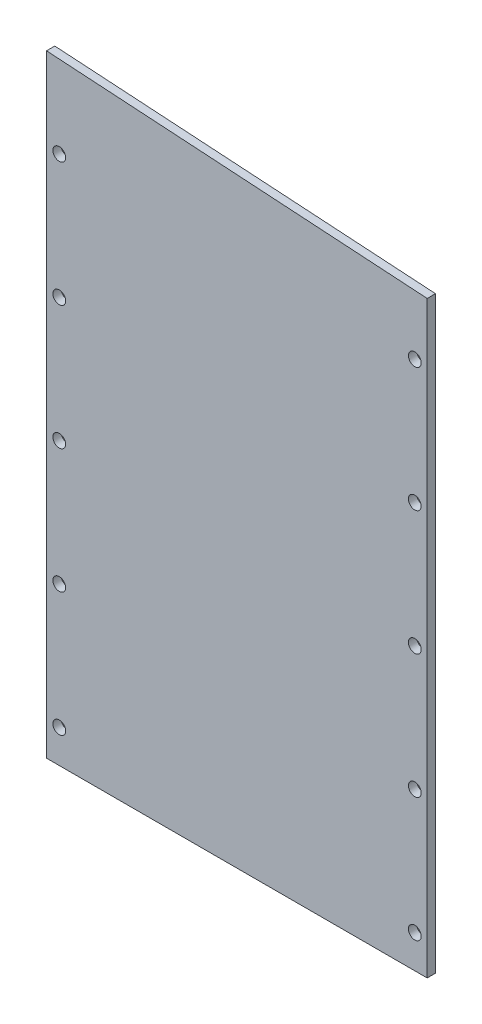
ISO-10303-21;
HEADER;
FILE_DESCRIPTION(('STEP AP214'),'2;1');
FILE_NAME('part.step','',(''),(''),'','','');
FILE_SCHEMA(('AUTOMOTIVE_DESIGN { 1 0 10303 214 1 1 1 1 }'));
ENDSEC;
DATA;
#1=APPLICATION_CONTEXT('core data for automotive mechanical design processes');
#2=APPLICATION_PROTOCOL_DEFINITION('international standard','automotive_design',2000,#1);
#3=PRODUCT_CONTEXT('',#1,'mechanical');
#4=PRODUCT('Part','Part','',(#3));
#5=PRODUCT_RELATED_PRODUCT_CATEGORY('part','',(#4));
#6=PRODUCT_DEFINITION_FORMATION('','',#4);
#7=PRODUCT_DEFINITION_CONTEXT('part definition',#1,'design');
#8=PRODUCT_DEFINITION('design','',#6,#7);
#9=PRODUCT_DEFINITION_SHAPE('','',#8);
#10=(LENGTH_UNIT() NAMED_UNIT(*) SI_UNIT(.MILLI.,.METRE.));
#11=(NAMED_UNIT(*) PLANE_ANGLE_UNIT() SI_UNIT($,.RADIAN.));
#12=(NAMED_UNIT(*) SI_UNIT($,.STERADIAN.) SOLID_ANGLE_UNIT());
#13=UNCERTAINTY_MEASURE_WITH_UNIT(LENGTH_MEASURE(1.E-05),#10,'distance_accuracy_value','');
#14=(GEOMETRIC_REPRESENTATION_CONTEXT(3) GLOBAL_UNCERTAINTY_ASSIGNED_CONTEXT((#13)) GLOBAL_UNIT_ASSIGNED_CONTEXT((#10,
#11,#12)) REPRESENTATION_CONTEXT('',''));
#15=CARTESIAN_POINT('',(0.,0.,0.));
#16=DIRECTION('',(0.,0.,1.));
#17=DIRECTION('',(1.,0.,0.));
#18=AXIS2_PLACEMENT_3D('',#15,#16,#17);
#19=CARTESIAN_POINT('',(-829.363556946388,6406.61289504105,3.175));
#20=DIRECTION('',(-1.,0.,0.));
#21=DIRECTION('',(0.,0.,1.));
#22=AXIS2_PLACEMENT_3D('',#19,#20,#21);
#23=PLANE('',#22);
#24=DIRECTION('',(0.,1.,0.));
#25=VECTOR('',#24,1.);
#26=CARTESIAN_POINT('',(-829.363556946388,6406.61289504105,0.));
#27=LINE('',#26,#25);
#28=CARTESIAN_POINT('',(-829.363556946388,6406.61289504105,0.));
#29=VERTEX_POINT('',#28);
#30=CARTESIAN_POINT('',(-829.363556946388,6632.38959884214,0.));
#31=VERTEX_POINT('',#30);
#32=EDGE_CURVE('E106',#29,#31,#27,.T.);
#33=ORIENTED_EDGE('',*,*,#32,.T.);
#34=DIRECTION('',(0.,0.,-1.));
#35=VECTOR('',#34,1.);
#36=CARTESIAN_POINT('',(-829.363556946388,6632.38959884214,3.175));
#37=LINE('',#36,#35);
#38=CARTESIAN_POINT('',(-829.363556946388,6632.38959884214,3.175));
#39=VERTEX_POINT('',#38);
#40=EDGE_CURVE('E11',#39,#31,#37,.T.);
#41=ORIENTED_EDGE('',*,*,#40,.F.);
#42=DIRECTION('',(0.,1.,0.));
#43=VECTOR('',#42,1.);
#44=CARTESIAN_POINT('',(-829.363556946388,6406.61289504105,3.175));
#45=LINE('',#44,#43);
#46=CARTESIAN_POINT('',(-829.363556946388,6406.61289504105,3.175));
#47=VERTEX_POINT('',#46);
#48=EDGE_CURVE('E88',#47,#39,#45,.T.);
#49=ORIENTED_EDGE('',*,*,#48,.F.);
#50=DIRECTION('',(0.,0.,-1.));
#51=VECTOR('',#50,1.);
#52=CARTESIAN_POINT('',(-829.363556946388,6406.61289504105,3.175));
#53=LINE('',#52,#51);
#54=EDGE_CURVE('E102',#47,#29,#53,.T.);
#55=ORIENTED_EDGE('',*,*,#54,.T.);
#56=EDGE_LOOP('',(#33,#41,#49,#55));
#57=FACE_BOUND('',#56,.T.);
#58=ADVANCED_FACE('F36',(#57),#23,.F.);
#59=CARTESIAN_POINT('',(-829.363556946388,6632.38959884214,3.175));
#60=DIRECTION('',(-0.0632532756957823,-0.997997506566902,0.));
#61=DIRECTION('',(0.997997506566902,-0.0632532756957823,0.));
#62=AXIS2_PLACEMENT_3D('',#59,#60,#61);
#63=PLANE('',#62);
#64=DIRECTION('',(-0.997997506566902,0.0632532756957823,0.));
#65=VECTOR('',#64,1.);
#66=CARTESIAN_POINT('',(-829.363556946388,6632.38959884214,0.));
#67=LINE('',#66,#65);
#68=CARTESIAN_POINT('',(-975.41355694639,6641.64627619311,0.));
#69=VERTEX_POINT('',#68);
#70=EDGE_CURVE('E93',#31,#69,#67,.T.);
#71=ORIENTED_EDGE('',*,*,#70,.T.);
#72=DIRECTION('',(0.,0.,-1.));
#73=VECTOR('',#72,1.);
#74=CARTESIAN_POINT('',(-975.41355694639,6641.64627619311,3.175));
#75=LINE('',#74,#73);
#76=CARTESIAN_POINT('',(-975.41355694639,6641.64627619311,3.175));
#77=VERTEX_POINT('',#76);
#78=EDGE_CURVE('E45',#77,#69,#75,.T.);
#79=ORIENTED_EDGE('',*,*,#78,.F.);
#80=DIRECTION('',(-0.997997506566902,0.0632532756957823,0.));
#81=VECTOR('',#80,1.);
#82=CARTESIAN_POINT('',(-829.363556946388,6632.38959884214,3.175));
#83=LINE('',#82,#81);
#84=EDGE_CURVE('E83',#39,#77,#83,.T.);
#85=ORIENTED_EDGE('',*,*,#84,.F.);
#86=ORIENTED_EDGE('',*,*,#40,.T.);
#87=EDGE_LOOP('',(#71,#79,#85,#86));
#88=FACE_BOUND('',#87,.T.);
#89=ADVANCED_FACE('F92',(#88),#63,.F.);
#90=CARTESIAN_POINT('',(-975.41355694639,6406.61289504105,3.175));
#91=DIRECTION('',(1.,0.,0.));
#92=DIRECTION('',(0.,0.,-1.));
#93=AXIS2_PLACEMENT_3D('',#90,#91,#92);
#94=PLANE('',#93);
#95=DIRECTION('',(0.,-1.,0.));
#96=VECTOR('',#95,1.);
#97=CARTESIAN_POINT('',(-975.41355694639,6406.61289504105,0.));
#98=LINE('',#97,#96);
#99=CARTESIAN_POINT('',(-975.41355694639,6406.61289504105,0.));
#100=VERTEX_POINT('',#99);
#101=EDGE_CURVE('E70',#69,#100,#98,.T.);
#102=ORIENTED_EDGE('',*,*,#101,.T.);
#103=DIRECTION('',(0.,0.,-1.));
#104=VECTOR('',#103,1.);
#105=CARTESIAN_POINT('',(-975.41355694639,6406.61289504105,3.175));
#106=LINE('',#105,#104);
#107=CARTESIAN_POINT('',(-975.41355694639,6406.61289504105,3.175));
#108=VERTEX_POINT('',#107);
#109=EDGE_CURVE('E95',#108,#100,#106,.T.);
#110=ORIENTED_EDGE('',*,*,#109,.F.);
#111=DIRECTION('',(0.,-1.,0.));
#112=VECTOR('',#111,1.);
#113=CARTESIAN_POINT('',(-975.41355694639,6406.61289504105,3.175));
#114=LINE('',#113,#112);
#115=EDGE_CURVE('E86',#77,#108,#114,.T.);
#116=ORIENTED_EDGE('',*,*,#115,.F.);
#117=ORIENTED_EDGE('',*,*,#78,.T.);
#118=EDGE_LOOP('',(#102,#110,#116,#117));
#119=FACE_BOUND('',#118,.T.);
#120=ADVANCED_FACE('F96',(#119),#94,.F.);
#121=CARTESIAN_POINT('',(-829.363556946388,6406.61289504105,3.175));
#122=DIRECTION('',(0.,1.,0.));
#123=DIRECTION('',(0.,0.,1.));
#124=AXIS2_PLACEMENT_3D('',#121,#122,#123);
#125=PLANE('',#124);
#126=DIRECTION('',(1.,0.,0.));
#127=VECTOR('',#126,1.);
#128=CARTESIAN_POINT('',(-829.363556946388,6406.61289504105,0.));
#129=LINE('',#128,#127);
#130=EDGE_CURVE('E76',#100,#29,#129,.T.);
#131=ORIENTED_EDGE('',*,*,#130,.T.);
#132=ORIENTED_EDGE('',*,*,#54,.F.);
#133=DIRECTION('',(1.,0.,0.));
#134=VECTOR('',#133,1.);
#135=CARTESIAN_POINT('',(-829.363556946388,6406.61289504105,3.175));
#136=LINE('',#135,#134);
#137=EDGE_CURVE('E53',#108,#47,#136,.T.);
#138=ORIENTED_EDGE('',*,*,#137,.F.);
#139=ORIENTED_EDGE('',*,*,#109,.T.);
#140=EDGE_LOOP('',(#131,#132,#138,#139));
#141=FACE_BOUND('',#140,.T.);
#142=ADVANCED_FACE('F120',(#141),#125,.F.);
#143=CARTESIAN_POINT('',(0.,0.,3.175));
#144=DIRECTION('',(0.,0.,1.));
#145=DIRECTION('',(1.,0.,0.));
#146=AXIS2_PLACEMENT_3D('',#143,#144,#145);
#147=PLANE('',#146);
#148=CARTESIAN_POINT('',(-970.524056946439,6609.81289504105,3.175));
#149=DIRECTION('',(0.,0.,1.));
#150=DIRECTION('',(1.,0.,0.));
#151=AXIS2_PLACEMENT_3D('',#148,#149,#150);
#152=CIRCLE('',#151,2.45744999999997);
#153=CARTESIAN_POINT('',(-968.066606946439,6609.81289504105,3.175));
#154=VERTEX_POINT('',#153);
#155=EDGE_CURVE('E200',#154,#154,#152,.T.);
#156=ORIENTED_EDGE('',*,*,#155,.F.);
#157=EDGE_LOOP('',(#156));
#158=FACE_BOUND('',#157,.T.);
#159=CARTESIAN_POINT('',(-970.524056946439,6562.18789504105,3.175));
#160=DIRECTION('',(0.,0.,1.));
#161=DIRECTION('',(1.,0.,0.));
#162=AXIS2_PLACEMENT_3D('',#159,#160,#161);
#163=CIRCLE('',#162,2.45744999999997);
#164=CARTESIAN_POINT('',(-968.066606946439,6562.18789504105,3.175));
#165=VERTEX_POINT('',#164);
#166=EDGE_CURVE('E192',#165,#165,#163,.T.);
#167=ORIENTED_EDGE('',*,*,#166,.F.);
#168=EDGE_LOOP('',(#167));
#169=FACE_BOUND('',#168,.T.);
#170=CARTESIAN_POINT('',(-970.524056946439,6514.56289504105,3.175));
#171=DIRECTION('',(0.,0.,1.));
#172=DIRECTION('',(1.,0.,0.));
#173=AXIS2_PLACEMENT_3D('',#170,#171,#172);
#174=CIRCLE('',#173,2.45744999999997);
#175=CARTESIAN_POINT('',(-968.066606946439,6514.56289504105,3.175));
#176=VERTEX_POINT('',#175);
#177=EDGE_CURVE('E184',#176,#176,#174,.T.);
#178=ORIENTED_EDGE('',*,*,#177,.F.);
#179=EDGE_LOOP('',(#178));
#180=FACE_BOUND('',#179,.T.);
#181=CARTESIAN_POINT('',(-970.524056946439,6466.93789504105,3.175));
#182=DIRECTION('',(0.,0.,1.));
#183=DIRECTION('',(1.,0.,0.));
#184=AXIS2_PLACEMENT_3D('',#181,#182,#183);
#185=CIRCLE('',#184,2.45744999999997);
#186=CARTESIAN_POINT('',(-968.066606946439,6466.93789504105,3.175));
#187=VERTEX_POINT('',#186);
#188=EDGE_CURVE('E177',#187,#187,#185,.T.);
#189=ORIENTED_EDGE('',*,*,#188,.F.);
#190=EDGE_LOOP('',(#189));
#191=FACE_BOUND('',#190,.T.);
#192=CARTESIAN_POINT('',(-970.524056946439,6419.31289504105,3.175));
#193=DIRECTION('',(0.,0.,1.));
#194=DIRECTION('',(1.,0.,0.));
#195=AXIS2_PLACEMENT_3D('',#192,#193,#194);
#196=CIRCLE('',#195,2.45744999999997);
#197=CARTESIAN_POINT('',(-968.066606946439,6419.31289504105,3.175));
#198=VERTEX_POINT('',#197);
#199=EDGE_CURVE('E169',#198,#198,#196,.T.);
#200=ORIENTED_EDGE('',*,*,#199,.F.);
#201=EDGE_LOOP('',(#200));
#202=FACE_BOUND('',#201,.T.);
#203=CARTESIAN_POINT('',(-834.126056946439,6419.31289504105,3.175));
#204=DIRECTION('',(0.,0.,1.));
#205=DIRECTION('',(1.,0.,0.));
#206=AXIS2_PLACEMENT_3D('',#203,#204,#205);
#207=CIRCLE('',#206,2.45744999999997);
#208=CARTESIAN_POINT('',(-831.668606946439,6419.31289504105,3.175));
#209=VERTEX_POINT('',#208);
#210=EDGE_CURVE('E162',#209,#209,#207,.T.);
#211=ORIENTED_EDGE('',*,*,#210,.F.);
#212=EDGE_LOOP('',(#211));
#213=FACE_BOUND('',#212,.T.);
#214=CARTESIAN_POINT('',(-834.126056946439,6466.93789504105,3.175));
#215=DIRECTION('',(0.,0.,1.));
#216=DIRECTION('',(1.,0.,0.));
#217=AXIS2_PLACEMENT_3D('',#214,#215,#216);
#218=CIRCLE('',#217,2.45744999999997);
#219=CARTESIAN_POINT('',(-831.668606946439,6466.93789504105,3.175));
#220=VERTEX_POINT('',#219);
#221=EDGE_CURVE('E155',#220,#220,#218,.T.);
#222=ORIENTED_EDGE('',*,*,#221,.F.);
#223=EDGE_LOOP('',(#222));
#224=FACE_BOUND('',#223,.T.);
#225=CARTESIAN_POINT('',(-834.126056946439,6514.56289504105,3.175));
#226=DIRECTION('',(0.,0.,1.));
#227=DIRECTION('',(1.,0.,0.));
#228=AXIS2_PLACEMENT_3D('',#225,#226,#227);
#229=CIRCLE('',#228,2.45744999999997);
#230=CARTESIAN_POINT('',(-831.668606946439,6514.56289504105,3.175));
#231=VERTEX_POINT('',#230);
#232=EDGE_CURVE('E147',#231,#231,#229,.T.);
#233=ORIENTED_EDGE('',*,*,#232,.F.);
#234=EDGE_LOOP('',(#233));
#235=FACE_BOUND('',#234,.T.);
#236=CARTESIAN_POINT('',(-834.126056946439,6562.18789504105,3.175));
#237=DIRECTION('',(0.,0.,1.));
#238=DIRECTION('',(1.,0.,0.));
#239=AXIS2_PLACEMENT_3D('',#236,#237,#238);
#240=CIRCLE('',#239,2.45744999999997);
#241=CARTESIAN_POINT('',(-831.668606946439,6562.18789504105,3.175));
#242=VERTEX_POINT('',#241);
#243=EDGE_CURVE('E139',#242,#242,#240,.T.);
#244=ORIENTED_EDGE('',*,*,#243,.F.);
#245=EDGE_LOOP('',(#244));
#246=FACE_BOUND('',#245,.T.);
#247=CARTESIAN_POINT('',(-834.12605694644,6609.81289504105,3.175));
#248=DIRECTION('',(0.,0.,1.));
#249=DIRECTION('',(1.,0.,0.));
#250=AXIS2_PLACEMENT_3D('',#247,#248,#249);
#251=CIRCLE('',#250,2.45744999999997);
#252=CARTESIAN_POINT('',(-831.66860694644,6609.81289504105,3.175));
#253=VERTEX_POINT('',#252);
#254=EDGE_CURVE('E132',#253,#253,#251,.T.);
#255=ORIENTED_EDGE('',*,*,#254,.F.);
#256=EDGE_LOOP('',(#255));
#257=FACE_BOUND('',#256,.T.);
#258=ORIENTED_EDGE('',*,*,#48,.T.);
#259=ORIENTED_EDGE('',*,*,#84,.T.);
#260=ORIENTED_EDGE('',*,*,#115,.T.);
#261=ORIENTED_EDGE('',*,*,#137,.T.);
#262=EDGE_LOOP('',(#258,#259,#260,#261));
#263=FACE_BOUND('',#262,.T.);
#264=ADVANCED_FACE('F84',(#158,#169,#180,#191,#202,#213,#224,#235,#246,#257,#263),#147,.T.);
#265=CARTESIAN_POINT('',(0.,0.,0.));
#266=DIRECTION('',(0.,0.,1.));
#267=DIRECTION('',(1.,0.,0.));
#268=AXIS2_PLACEMENT_3D('',#265,#266,#267);
#269=PLANE('',#268);
#270=CARTESIAN_POINT('',(-970.524056946439,6609.81289504105,0.));
#271=DIRECTION('',(0.,0.,1.));
#272=DIRECTION('',(1.,0.,0.));
#273=AXIS2_PLACEMENT_3D('',#270,#271,#272);
#274=CIRCLE('',#273,2.45744999999997);
#275=CARTESIAN_POINT('',(-968.066606946439,6609.81289504105,0.));
#276=VERTEX_POINT('',#275);
#277=EDGE_CURVE('E196',#276,#276,#274,.T.);
#278=ORIENTED_EDGE('',*,*,#277,.T.);
#279=EDGE_LOOP('',(#278));
#280=FACE_BOUND('',#279,.T.);
#281=CARTESIAN_POINT('',(-970.524056946439,6562.18789504105,0.));
#282=DIRECTION('',(0.,0.,1.));
#283=DIRECTION('',(1.,0.,0.));
#284=AXIS2_PLACEMENT_3D('',#281,#282,#283);
#285=CIRCLE('',#284,2.45744999999997);
#286=CARTESIAN_POINT('',(-968.066606946439,6562.18789504105,0.));
#287=VERTEX_POINT('',#286);
#288=EDGE_CURVE('E188',#287,#287,#285,.T.);
#289=ORIENTED_EDGE('',*,*,#288,.T.);
#290=EDGE_LOOP('',(#289));
#291=FACE_BOUND('',#290,.T.);
#292=CARTESIAN_POINT('',(-970.524056946439,6514.56289504105,0.));
#293=DIRECTION('',(0.,0.,1.));
#294=DIRECTION('',(1.,0.,0.));
#295=AXIS2_PLACEMENT_3D('',#292,#293,#294);
#296=CIRCLE('',#295,2.45744999999997);
#297=CARTESIAN_POINT('',(-968.066606946439,6514.56289504105,0.));
#298=VERTEX_POINT('',#297);
#299=EDGE_CURVE('E180',#298,#298,#296,.T.);
#300=ORIENTED_EDGE('',*,*,#299,.T.);
#301=EDGE_LOOP('',(#300));
#302=FACE_BOUND('',#301,.T.);
#303=CARTESIAN_POINT('',(-970.524056946439,6466.93789504105,0.));
#304=DIRECTION('',(0.,0.,1.));
#305=DIRECTION('',(1.,0.,0.));
#306=AXIS2_PLACEMENT_3D('',#303,#304,#305);
#307=CIRCLE('',#306,2.45744999999997);
#308=CARTESIAN_POINT('',(-968.066606946439,6466.93789504105,0.));
#309=VERTEX_POINT('',#308);
#310=EDGE_CURVE('E173',#309,#309,#307,.T.);
#311=ORIENTED_EDGE('',*,*,#310,.T.);
#312=EDGE_LOOP('',(#311));
#313=FACE_BOUND('',#312,.T.);
#314=CARTESIAN_POINT('',(-970.524056946439,6419.31289504105,0.));
#315=DIRECTION('',(0.,0.,1.));
#316=DIRECTION('',(1.,0.,0.));
#317=AXIS2_PLACEMENT_3D('',#314,#315,#316);
#318=CIRCLE('',#317,2.45744999999997);
#319=CARTESIAN_POINT('',(-968.066606946439,6419.31289504105,0.));
#320=VERTEX_POINT('',#319);
#321=EDGE_CURVE('E166',#320,#320,#318,.T.);
#322=ORIENTED_EDGE('',*,*,#321,.T.);
#323=EDGE_LOOP('',(#322));
#324=FACE_BOUND('',#323,.T.);
#325=CARTESIAN_POINT('',(-834.126056946439,6419.31289504105,0.));
#326=DIRECTION('',(0.,0.,1.));
#327=DIRECTION('',(1.,0.,0.));
#328=AXIS2_PLACEMENT_3D('',#325,#326,#327);
#329=CIRCLE('',#328,2.45744999999997);
#330=CARTESIAN_POINT('',(-831.668606946439,6419.31289504105,0.));
#331=VERTEX_POINT('',#330);
#332=EDGE_CURVE('E158',#331,#331,#329,.T.);
#333=ORIENTED_EDGE('',*,*,#332,.T.);
#334=EDGE_LOOP('',(#333));
#335=FACE_BOUND('',#334,.T.);
#336=CARTESIAN_POINT('',(-834.126056946439,6466.93789504105,0.));
#337=DIRECTION('',(0.,0.,1.));
#338=DIRECTION('',(1.,0.,0.));
#339=AXIS2_PLACEMENT_3D('',#336,#337,#338);
#340=CIRCLE('',#339,2.45744999999997);
#341=CARTESIAN_POINT('',(-831.668606946439,6466.93789504105,0.));
#342=VERTEX_POINT('',#341);
#343=EDGE_CURVE('E151',#342,#342,#340,.T.);
#344=ORIENTED_EDGE('',*,*,#343,.T.);
#345=EDGE_LOOP('',(#344));
#346=FACE_BOUND('',#345,.T.);
#347=CARTESIAN_POINT('',(-834.126056946439,6514.56289504105,0.));
#348=DIRECTION('',(0.,0.,1.));
#349=DIRECTION('',(1.,0.,0.));
#350=AXIS2_PLACEMENT_3D('',#347,#348,#349);
#351=CIRCLE('',#350,2.45744999999997);
#352=CARTESIAN_POINT('',(-831.668606946439,6514.56289504105,0.));
#353=VERTEX_POINT('',#352);
#354=EDGE_CURVE('E143',#353,#353,#351,.T.);
#355=ORIENTED_EDGE('',*,*,#354,.T.);
#356=EDGE_LOOP('',(#355));
#357=FACE_BOUND('',#356,.T.);
#358=CARTESIAN_POINT('',(-834.126056946439,6562.18789504105,0.));
#359=DIRECTION('',(0.,0.,1.));
#360=DIRECTION('',(1.,0.,0.));
#361=AXIS2_PLACEMENT_3D('',#358,#359,#360);
#362=CIRCLE('',#361,2.45744999999997);
#363=CARTESIAN_POINT('',(-831.668606946439,6562.18789504105,0.));
#364=VERTEX_POINT('',#363);
#365=EDGE_CURVE('E135',#364,#364,#362,.T.);
#366=ORIENTED_EDGE('',*,*,#365,.T.);
#367=EDGE_LOOP('',(#366));
#368=FACE_BOUND('',#367,.T.);
#369=CARTESIAN_POINT('',(-834.12605694644,6609.81289504105,0.));
#370=DIRECTION('',(0.,0.,1.));
#371=DIRECTION('',(1.,0.,0.));
#372=AXIS2_PLACEMENT_3D('',#369,#370,#371);
#373=CIRCLE('',#372,2.45744999999997);
#374=CARTESIAN_POINT('',(-831.66860694644,6609.81289504105,0.));
#375=VERTEX_POINT('',#374);
#376=EDGE_CURVE('E110',#375,#375,#373,.T.);
#377=ORIENTED_EDGE('',*,*,#376,.T.);
#378=EDGE_LOOP('',(#377));
#379=FACE_BOUND('',#378,.T.);
#380=ORIENTED_EDGE('',*,*,#32,.F.);
#381=ORIENTED_EDGE('',*,*,#130,.F.);
#382=ORIENTED_EDGE('',*,*,#101,.F.);
#383=ORIENTED_EDGE('',*,*,#70,.F.);
#384=EDGE_LOOP('',(#380,#381,#382,#383));
#385=FACE_BOUND('',#384,.T.);
#386=ADVANCED_FACE('F123',(#280,#291,#302,#313,#324,#335,#346,#357,#368,#379,#385),#269,.F.);
#387=CARTESIAN_POINT('',(-834.12605694644,6609.81289504105,3.175));
#388=DIRECTION('',(0.,0.,1.));
#389=DIRECTION('',(1.,0.,0.));
#390=AXIS2_PLACEMENT_3D('',#387,#388,#389);
#391=CYLINDRICAL_SURFACE('',#390,2.45744999999997);
#392=ORIENTED_EDGE('',*,*,#376,.F.);
#393=EDGE_LOOP('',(#392));
#394=FACE_BOUND('',#393,.T.);
#395=ORIENTED_EDGE('',*,*,#254,.T.);
#396=EDGE_LOOP('',(#395));
#397=FACE_BOUND('',#396,.T.);
#398=ADVANCED_FACE('F228',(#394,#397),#391,.F.);
#399=CARTESIAN_POINT('',(-834.126056946439,6562.18789504105,3.175));
#400=DIRECTION('',(0.,0.,1.));
#401=DIRECTION('',(1.,0.,0.));
#402=AXIS2_PLACEMENT_3D('',#399,#400,#401);
#403=CYLINDRICAL_SURFACE('',#402,2.45744999999997);
#404=ORIENTED_EDGE('',*,*,#365,.F.);
#405=EDGE_LOOP('',(#404));
#406=FACE_BOUND('',#405,.T.);
#407=ORIENTED_EDGE('',*,*,#243,.T.);
#408=EDGE_LOOP('',(#407));
#409=FACE_BOUND('',#408,.T.);
#410=ADVANCED_FACE('F230',(#406,#409),#403,.F.);
#411=CARTESIAN_POINT('',(-834.126056946439,6514.56289504105,3.175));
#412=DIRECTION('',(0.,0.,1.));
#413=DIRECTION('',(1.,0.,0.));
#414=AXIS2_PLACEMENT_3D('',#411,#412,#413);
#415=CYLINDRICAL_SURFACE('',#414,2.45744999999997);
#416=ORIENTED_EDGE('',*,*,#354,.F.);
#417=EDGE_LOOP('',(#416));
#418=FACE_BOUND('',#417,.T.);
#419=ORIENTED_EDGE('',*,*,#232,.T.);
#420=EDGE_LOOP('',(#419));
#421=FACE_BOUND('',#420,.T.);
#422=ADVANCED_FACE('F237',(#418,#421),#415,.F.);
#423=CARTESIAN_POINT('',(-834.126056946439,6466.93789504105,3.175));
#424=DIRECTION('',(0.,0.,1.));
#425=DIRECTION('',(1.,0.,0.));
#426=AXIS2_PLACEMENT_3D('',#423,#424,#425);
#427=CYLINDRICAL_SURFACE('',#426,2.45744999999997);
#428=ORIENTED_EDGE('',*,*,#343,.F.);
#429=EDGE_LOOP('',(#428));
#430=FACE_BOUND('',#429,.T.);
#431=ORIENTED_EDGE('',*,*,#221,.T.);
#432=EDGE_LOOP('',(#431));
#433=FACE_BOUND('',#432,.T.);
#434=ADVANCED_FACE('F278',(#430,#433),#427,.F.);
#435=CARTESIAN_POINT('',(-834.126056946439,6419.31289504105,3.175));
#436=DIRECTION('',(0.,0.,1.));
#437=DIRECTION('',(1.,0.,0.));
#438=AXIS2_PLACEMENT_3D('',#435,#436,#437);
#439=CYLINDRICAL_SURFACE('',#438,2.45744999999997);
#440=ORIENTED_EDGE('',*,*,#332,.F.);
#441=EDGE_LOOP('',(#440));
#442=FACE_BOUND('',#441,.T.);
#443=ORIENTED_EDGE('',*,*,#210,.T.);
#444=EDGE_LOOP('',(#443));
#445=FACE_BOUND('',#444,.T.);
#446=ADVANCED_FACE('F287',(#442,#445),#439,.F.);
#447=CARTESIAN_POINT('',(-970.524056946439,6419.31289504105,3.175));
#448=DIRECTION('',(0.,0.,1.));
#449=DIRECTION('',(1.,0.,0.));
#450=AXIS2_PLACEMENT_3D('',#447,#448,#449);
#451=CYLINDRICAL_SURFACE('',#450,2.45744999999997);
#452=ORIENTED_EDGE('',*,*,#321,.F.);
#453=EDGE_LOOP('',(#452));
#454=FACE_BOUND('',#453,.T.);
#455=ORIENTED_EDGE('',*,*,#199,.T.);
#456=EDGE_LOOP('',(#455));
#457=FACE_BOUND('',#456,.T.);
#458=ADVANCED_FACE('F296',(#454,#457),#451,.F.);
#459=CARTESIAN_POINT('',(-970.524056946439,6466.93789504105,3.175));
#460=DIRECTION('',(0.,0.,1.));
#461=DIRECTION('',(1.,0.,0.));
#462=AXIS2_PLACEMENT_3D('',#459,#460,#461);
#463=CYLINDRICAL_SURFACE('',#462,2.45744999999997);
#464=ORIENTED_EDGE('',*,*,#310,.F.);
#465=EDGE_LOOP('',(#464));
#466=FACE_BOUND('',#465,.T.);
#467=ORIENTED_EDGE('',*,*,#188,.T.);
#468=EDGE_LOOP('',(#467));
#469=FACE_BOUND('',#468,.T.);
#470=ADVANCED_FACE('F305',(#466,#469),#463,.F.);
#471=CARTESIAN_POINT('',(-970.524056946439,6514.56289504105,3.175));
#472=DIRECTION('',(0.,0.,1.));
#473=DIRECTION('',(1.,0.,0.));
#474=AXIS2_PLACEMENT_3D('',#471,#472,#473);
#475=CYLINDRICAL_SURFACE('',#474,2.45744999999997);
#476=ORIENTED_EDGE('',*,*,#299,.F.);
#477=EDGE_LOOP('',(#476));
#478=FACE_BOUND('',#477,.T.);
#479=ORIENTED_EDGE('',*,*,#177,.T.);
#480=EDGE_LOOP('',(#479));
#481=FACE_BOUND('',#480,.T.);
#482=ADVANCED_FACE('F314',(#478,#481),#475,.F.);
#483=CARTESIAN_POINT('',(-970.524056946439,6562.18789504105,3.175));
#484=DIRECTION('',(0.,0.,1.));
#485=DIRECTION('',(1.,0.,0.));
#486=AXIS2_PLACEMENT_3D('',#483,#484,#485);
#487=CYLINDRICAL_SURFACE('',#486,2.45744999999997);
#488=ORIENTED_EDGE('',*,*,#288,.F.);
#489=EDGE_LOOP('',(#488));
#490=FACE_BOUND('',#489,.T.);
#491=ORIENTED_EDGE('',*,*,#166,.T.);
#492=EDGE_LOOP('',(#491));
#493=FACE_BOUND('',#492,.T.);
#494=ADVANCED_FACE('F323',(#490,#493),#487,.F.);
#495=CARTESIAN_POINT('',(-970.524056946439,6609.81289504105,3.175));
#496=DIRECTION('',(0.,0.,1.));
#497=DIRECTION('',(1.,0.,0.));
#498=AXIS2_PLACEMENT_3D('',#495,#496,#497);
#499=CYLINDRICAL_SURFACE('',#498,2.45744999999997);
#500=ORIENTED_EDGE('',*,*,#277,.F.);
#501=EDGE_LOOP('',(#500));
#502=FACE_BOUND('',#501,.T.);
#503=ORIENTED_EDGE('',*,*,#155,.T.);
#504=EDGE_LOOP('',(#503));
#505=FACE_BOUND('',#504,.T.);
#506=ADVANCED_FACE('F205',(#502,#505),#499,.F.);
#507=CLOSED_SHELL('',(#58,#89,#120,#142,#264,#386,#398,#410,#422,#434,#446,#458,#470,#482,#494,#506));
#508=MANIFOLD_SOLID_BREP('B2',#507);
#509=ADVANCED_BREP_SHAPE_REPRESENTATION('',(#18,#508),#14);
#510=SHAPE_DEFINITION_REPRESENTATION(#9,#509);
ENDSEC;
END-ISO-10303-21;
